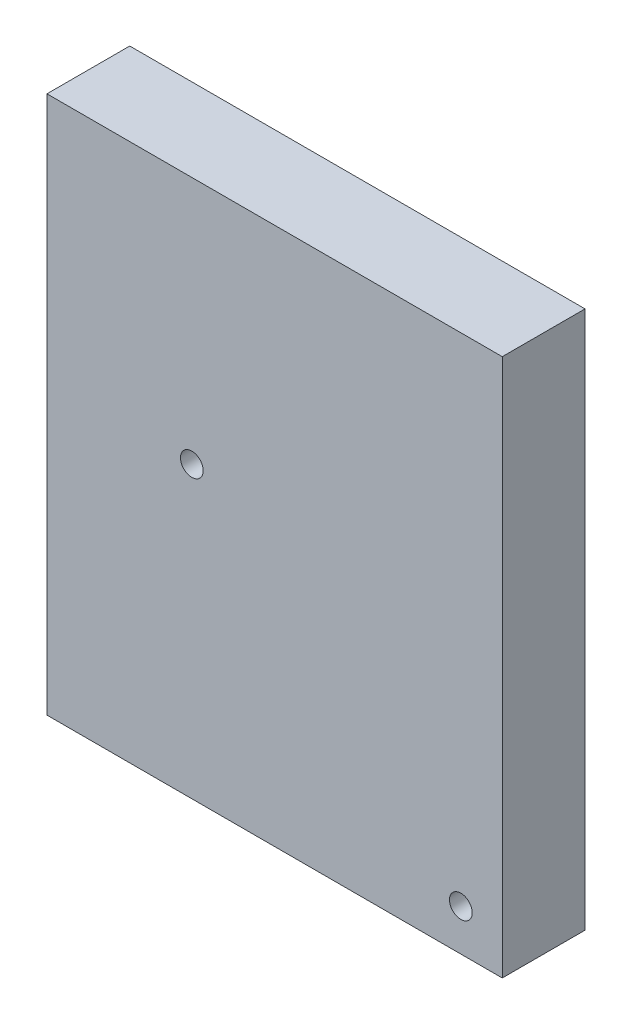
ISO-10303-21;
HEADER;
FILE_DESCRIPTION(('STEP AP214'),'2;1');
FILE_NAME('part.step','',(''),(''),'','','');
FILE_SCHEMA(('AUTOMOTIVE_DESIGN { 1 0 10303 214 1 1 1 1 }'));
ENDSEC;
DATA;
#1=APPLICATION_CONTEXT('core data for automotive mechanical design processes');
#2=APPLICATION_PROTOCOL_DEFINITION('international standard','automotive_design',2000,#1);
#3=PRODUCT_CONTEXT('',#1,'mechanical');
#4=PRODUCT('Part','Part','',(#3));
#5=PRODUCT_RELATED_PRODUCT_CATEGORY('part','',(#4));
#6=PRODUCT_DEFINITION_FORMATION('','',#4);
#7=PRODUCT_DEFINITION_CONTEXT('part definition',#1,'design');
#8=PRODUCT_DEFINITION('design','',#6,#7);
#9=PRODUCT_DEFINITION_SHAPE('','',#8);
#10=(LENGTH_UNIT() NAMED_UNIT(*) SI_UNIT(.MILLI.,.METRE.));
#11=(NAMED_UNIT(*) PLANE_ANGLE_UNIT() SI_UNIT($,.RADIAN.));
#12=(NAMED_UNIT(*) SI_UNIT($,.STERADIAN.) SOLID_ANGLE_UNIT());
#13=UNCERTAINTY_MEASURE_WITH_UNIT(LENGTH_MEASURE(1.E-05),#10,'distance_accuracy_value','');
#14=(GEOMETRIC_REPRESENTATION_CONTEXT(3) GLOBAL_UNCERTAINTY_ASSIGNED_CONTEXT((#13)) GLOBAL_UNIT_ASSIGNED_CONTEXT((#10,
#11,#12)) REPRESENTATION_CONTEXT('',''));
#15=CARTESIAN_POINT('',(0.,0.,0.));
#16=DIRECTION('',(0.,0.,1.));
#17=DIRECTION('',(1.,0.,0.));
#18=AXIS2_PLACEMENT_3D('',#15,#16,#17);
#19=CARTESIAN_POINT('',(27.94,33.02,10.16));
#20=DIRECTION('',(0.,0.,-1.));
#21=DIRECTION('',(-1.,0.,0.));
#22=AXIS2_PLACEMENT_3D('',#19,#20,#21);
#23=PLANE('',#22);
#24=CARTESIAN_POINT('',(-10.16,2.53999999999999,10.16));
#25=DIRECTION('',(0.,0.,1.));
#26=DIRECTION('',(1.,0.,0.));
#27=AXIS2_PLACEMENT_3D('',#24,#25,#26);
#28=CIRCLE('',#27,1.397);
#29=CARTESIAN_POINT('',(-8.76300000000001,2.53999999999999,10.16));
#30=VERTEX_POINT('',#29);
#31=EDGE_CURVE('E102',#30,#30,#28,.T.);
#32=ORIENTED_EDGE('',*,*,#31,.F.);
#33=EDGE_LOOP('',(#32));
#34=FACE_BOUND('',#33,.T.);
#35=DIRECTION('',(0.,1.,0.));
#36=VECTOR('',#35,1.);
#37=CARTESIAN_POINT('',(27.94,-33.02,10.16));
#38=LINE('',#37,#36);
#39=CARTESIAN_POINT('',(27.94,-33.02,10.16));
#40=VERTEX_POINT('',#39);
#41=CARTESIAN_POINT('',(27.94,33.02,10.16));
#42=VERTEX_POINT('',#41);
#43=EDGE_CURVE('E87',#40,#42,#38,.T.);
#44=ORIENTED_EDGE('',*,*,#43,.T.);
#45=DIRECTION('',(-1.,0.,0.));
#46=VECTOR('',#45,1.);
#47=CARTESIAN_POINT('',(-27.94,33.02,10.16));
#48=LINE('',#47,#46);
#49=CARTESIAN_POINT('',(-27.94,33.02,10.16));
#50=VERTEX_POINT('',#49);
#51=EDGE_CURVE('E82',#42,#50,#48,.T.);
#52=ORIENTED_EDGE('',*,*,#51,.T.);
#53=DIRECTION('',(0.,-1.,0.));
#54=VECTOR('',#53,1.);
#55=CARTESIAN_POINT('',(-27.94,-33.02,10.16));
#56=LINE('',#55,#54);
#57=CARTESIAN_POINT('',(-27.94,-33.02,10.16));
#58=VERTEX_POINT('',#57);
#59=EDGE_CURVE('E85',#50,#58,#56,.T.);
#60=ORIENTED_EDGE('',*,*,#59,.T.);
#61=DIRECTION('',(1.,0.,0.));
#62=VECTOR('',#61,1.);
#63=CARTESIAN_POINT('',(-27.94,-33.02,10.16));
#64=LINE('',#63,#62);
#65=EDGE_CURVE('E52',#58,#40,#64,.T.);
#66=ORIENTED_EDGE('',*,*,#65,.T.);
#67=EDGE_LOOP('',(#44,#52,#60,#66));
#68=FACE_BOUND('',#67,.T.);
#69=CARTESIAN_POINT('',(22.86,-27.94,10.16));
#70=DIRECTION('',(0.,0.,1.));
#71=DIRECTION('',(1.,0.,0.));
#72=AXIS2_PLACEMENT_3D('',#69,#70,#71);
#73=CIRCLE('',#72,1.397);
#74=CARTESIAN_POINT('',(24.257,-27.94,10.16));
#75=VERTEX_POINT('',#74);
#76=EDGE_CURVE('E117',#75,#75,#73,.T.);
#77=ORIENTED_EDGE('',*,*,#76,.F.);
#78=EDGE_LOOP('',(#77));
#79=FACE_BOUND('',#78,.T.);
#80=ADVANCED_FACE('F35',(#34,#68,#79),#23,.F.);
#81=CARTESIAN_POINT('',(27.94,33.02,0.));
#82=DIRECTION('',(0.,0.,-1.));
#83=DIRECTION('',(-1.,0.,0.));
#84=AXIS2_PLACEMENT_3D('',#81,#82,#83);
#85=PLANE('',#84);
#86=CARTESIAN_POINT('',(-10.16,2.53999999999999,0.));
#87=DIRECTION('',(0.,0.,1.));
#88=DIRECTION('',(1.,0.,0.));
#89=AXIS2_PLACEMENT_3D('',#86,#87,#88);
#90=CIRCLE('',#89,1.397);
#91=CARTESIAN_POINT('',(-8.76300000000001,2.53999999999999,0.));
#92=VERTEX_POINT('',#91);
#93=EDGE_CURVE('E114',#92,#92,#90,.T.);
#94=ORIENTED_EDGE('',*,*,#93,.T.);
#95=EDGE_LOOP('',(#94));
#96=FACE_BOUND('',#95,.T.);
#97=DIRECTION('',(0.,1.,0.));
#98=VECTOR('',#97,1.);
#99=CARTESIAN_POINT('',(27.94,-33.02,0.));
#100=LINE('',#99,#98);
#101=CARTESIAN_POINT('',(27.94,-33.02,0.));
#102=VERTEX_POINT('',#101);
#103=CARTESIAN_POINT('',(27.94,33.02,0.));
#104=VERTEX_POINT('',#103);
#105=EDGE_CURVE('E99',#102,#104,#100,.T.);
#106=ORIENTED_EDGE('',*,*,#105,.F.);
#107=DIRECTION('',(1.,0.,0.));
#108=VECTOR('',#107,1.);
#109=CARTESIAN_POINT('',(-27.94,-33.02,0.));
#110=LINE('',#109,#108);
#111=CARTESIAN_POINT('',(-27.94,-33.02,0.));
#112=VERTEX_POINT('',#111);
#113=EDGE_CURVE('E75',#112,#102,#110,.T.);
#114=ORIENTED_EDGE('',*,*,#113,.F.);
#115=DIRECTION('',(0.,-1.,0.));
#116=VECTOR('',#115,1.);
#117=CARTESIAN_POINT('',(-27.94,-33.02,0.));
#118=LINE('',#117,#116);
#119=CARTESIAN_POINT('',(-27.94,33.02,0.));
#120=VERTEX_POINT('',#119);
#121=EDGE_CURVE('E69',#120,#112,#118,.T.);
#122=ORIENTED_EDGE('',*,*,#121,.F.);
#123=DIRECTION('',(-1.,0.,0.));
#124=VECTOR('',#123,1.);
#125=CARTESIAN_POINT('',(-27.94,33.02,0.));
#126=LINE('',#125,#124);
#127=EDGE_CURVE('E91',#104,#120,#126,.T.);
#128=ORIENTED_EDGE('',*,*,#127,.F.);
#129=EDGE_LOOP('',(#106,#114,#122,#128));
#130=FACE_BOUND('',#129,.T.);
#131=CARTESIAN_POINT('',(22.86,-27.94,0.));
#132=DIRECTION('',(0.,0.,1.));
#133=DIRECTION('',(1.,0.,0.));
#134=AXIS2_PLACEMENT_3D('',#131,#132,#133);
#135=CIRCLE('',#134,1.397);
#136=CARTESIAN_POINT('',(24.257,-27.94,0.));
#137=VERTEX_POINT('',#136);
#138=EDGE_CURVE('E120',#137,#137,#135,.T.);
#139=ORIENTED_EDGE('',*,*,#138,.T.);
#140=EDGE_LOOP('',(#139));
#141=FACE_BOUND('',#140,.T.);
#142=ADVANCED_FACE('F110',(#96,#130,#141),#85,.T.);
#143=CARTESIAN_POINT('',(27.94,-33.02,10.16));
#144=DIRECTION('',(-1.,0.,0.));
#145=DIRECTION('',(0.,0.,1.));
#146=AXIS2_PLACEMENT_3D('',#143,#144,#145);
#147=PLANE('',#146);
#148=ORIENTED_EDGE('',*,*,#105,.T.);
#149=DIRECTION('',(0.,0.,-1.));
#150=VECTOR('',#149,1.);
#151=CARTESIAN_POINT('',(27.94,33.02,10.16));
#152=LINE('',#151,#150);
#153=EDGE_CURVE('E11',#42,#104,#152,.T.);
#154=ORIENTED_EDGE('',*,*,#153,.F.);
#155=ORIENTED_EDGE('',*,*,#43,.F.);
#156=DIRECTION('',(0.,0.,-1.));
#157=VECTOR('',#156,1.);
#158=CARTESIAN_POINT('',(27.94,-33.02,10.16));
#159=LINE('',#158,#157);
#160=EDGE_CURVE('E95',#40,#102,#159,.T.);
#161=ORIENTED_EDGE('',*,*,#160,.T.);
#162=EDGE_LOOP('',(#148,#154,#155,#161));
#163=FACE_BOUND('',#162,.T.);
#164=ADVANCED_FACE('F37',(#163),#147,.F.);
#165=CARTESIAN_POINT('',(-27.94,33.02,10.16));
#166=DIRECTION('',(0.,-1.,0.));
#167=DIRECTION('',(0.,0.,-1.));
#168=AXIS2_PLACEMENT_3D('',#165,#166,#167);
#169=PLANE('',#168);
#170=ORIENTED_EDGE('',*,*,#127,.T.);
#171=DIRECTION('',(0.,0.,-1.));
#172=VECTOR('',#171,1.);
#173=CARTESIAN_POINT('',(-27.94,33.02,10.16));
#174=LINE('',#173,#172);
#175=EDGE_CURVE('E44',#50,#120,#174,.T.);
#176=ORIENTED_EDGE('',*,*,#175,.F.);
#177=ORIENTED_EDGE('',*,*,#51,.F.);
#178=ORIENTED_EDGE('',*,*,#153,.T.);
#179=EDGE_LOOP('',(#170,#176,#177,#178));
#180=FACE_BOUND('',#179,.T.);
#181=ADVANCED_FACE('F90',(#180),#169,.F.);
#182=CARTESIAN_POINT('',(-27.94,-33.02,10.16));
#183=DIRECTION('',(1.,0.,0.));
#184=DIRECTION('',(0.,0.,-1.));
#185=AXIS2_PLACEMENT_3D('',#182,#183,#184);
#186=PLANE('',#185);
#187=ORIENTED_EDGE('',*,*,#121,.T.);
#188=DIRECTION('',(0.,0.,-1.));
#189=VECTOR('',#188,1.);
#190=CARTESIAN_POINT('',(-27.94,-33.02,10.16));
#191=LINE('',#190,#189);
#192=EDGE_CURVE('E92',#58,#112,#191,.T.);
#193=ORIENTED_EDGE('',*,*,#192,.F.);
#194=ORIENTED_EDGE('',*,*,#59,.F.);
#195=ORIENTED_EDGE('',*,*,#175,.T.);
#196=EDGE_LOOP('',(#187,#193,#194,#195));
#197=FACE_BOUND('',#196,.T.);
#198=ADVANCED_FACE('F93',(#197),#186,.F.);
#199=CARTESIAN_POINT('',(-27.94,-33.02,10.16));
#200=DIRECTION('',(0.,1.,0.));
#201=DIRECTION('',(0.,0.,1.));
#202=AXIS2_PLACEMENT_3D('',#199,#200,#201);
#203=PLANE('',#202);
#204=ORIENTED_EDGE('',*,*,#113,.T.);
#205=ORIENTED_EDGE('',*,*,#160,.F.);
#206=ORIENTED_EDGE('',*,*,#65,.F.);
#207=ORIENTED_EDGE('',*,*,#192,.T.);
#208=EDGE_LOOP('',(#204,#205,#206,#207));
#209=FACE_BOUND('',#208,.T.);
#210=ADVANCED_FACE('F107',(#209),#203,.F.);
#211=CARTESIAN_POINT('',(-10.16,2.53999999999999,10.16));
#212=DIRECTION('',(0.,0.,-1.));
#213=DIRECTION('',(-1.,0.,0.));
#214=AXIS2_PLACEMENT_3D('',#211,#212,#213);
#215=CYLINDRICAL_SURFACE('',#214,1.397);
#216=ORIENTED_EDGE('',*,*,#31,.T.);
#217=EDGE_LOOP('',(#216));
#218=FACE_BOUND('',#217,.T.);
#219=ORIENTED_EDGE('',*,*,#93,.F.);
#220=EDGE_LOOP('',(#219));
#221=FACE_BOUND('',#220,.T.);
#222=ADVANCED_FACE('F138',(#218,#221),#215,.F.);
#223=CARTESIAN_POINT('',(22.86,-27.94,10.16));
#224=DIRECTION('',(0.,0.,-1.));
#225=DIRECTION('',(-1.,0.,0.));
#226=AXIS2_PLACEMENT_3D('',#223,#224,#225);
#227=CYLINDRICAL_SURFACE('',#226,1.397);
#228=ORIENTED_EDGE('',*,*,#76,.T.);
#229=EDGE_LOOP('',(#228));
#230=FACE_BOUND('',#229,.T.);
#231=ORIENTED_EDGE('',*,*,#138,.F.);
#232=EDGE_LOOP('',(#231));
#233=FACE_BOUND('',#232,.T.);
#234=ADVANCED_FACE('F126',(#230,#233),#227,.F.);
#235=CLOSED_SHELL('',(#80,#142,#164,#181,#198,#210,#222,#234));
#236=MANIFOLD_SOLID_BREP('B2',#235);
#237=ADVANCED_BREP_SHAPE_REPRESENTATION('',(#18,#236),#14);
#238=SHAPE_DEFINITION_REPRESENTATION(#9,#237);
ENDSEC;
END-ISO-10303-21;
